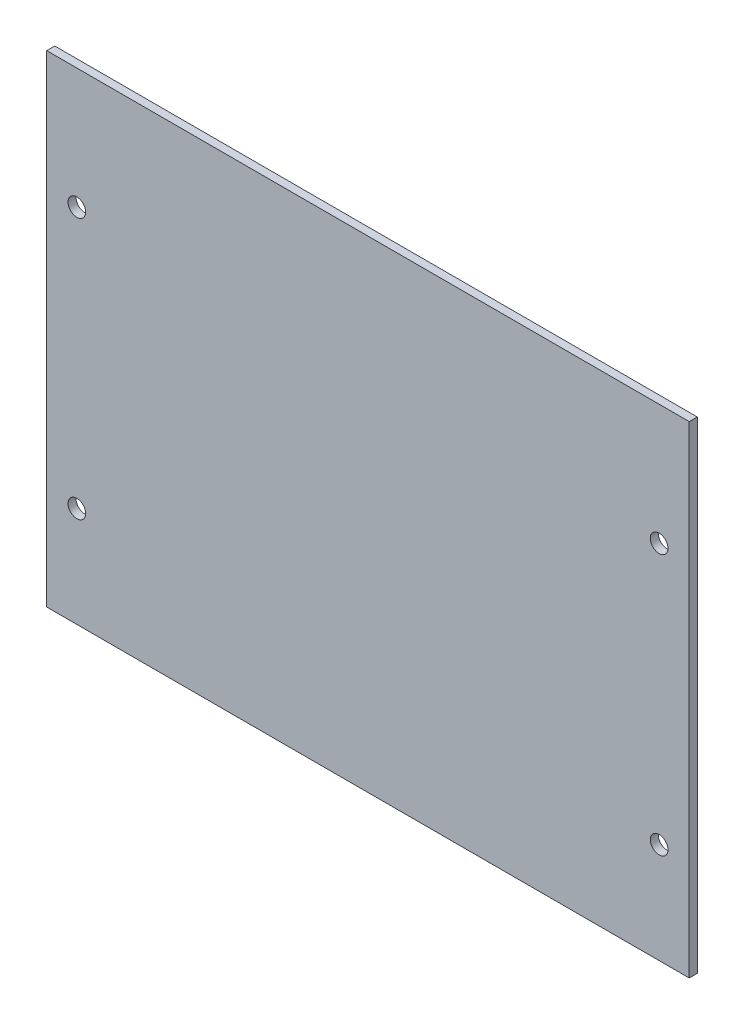
ISO-10303-21;
HEADER;
FILE_DESCRIPTION(('STEP AP214'),'2;1');
FILE_NAME('part.step','',(''),(''),'','','');
FILE_SCHEMA(('AUTOMOTIVE_DESIGN { 1 0 10303 214 1 1 1 1 }'));
ENDSEC;
DATA;
#1=APPLICATION_CONTEXT('core data for automotive mechanical design processes');
#2=APPLICATION_PROTOCOL_DEFINITION('international standard','automotive_design',2000,#1);
#3=PRODUCT_CONTEXT('',#1,'mechanical');
#4=PRODUCT('Part','Part','',(#3));
#5=PRODUCT_RELATED_PRODUCT_CATEGORY('part','',(#4));
#6=PRODUCT_DEFINITION_FORMATION('','',#4);
#7=PRODUCT_DEFINITION_CONTEXT('part definition',#1,'design');
#8=PRODUCT_DEFINITION('design','',#6,#7);
#9=PRODUCT_DEFINITION_SHAPE('','',#8);
#10=(LENGTH_UNIT() NAMED_UNIT(*) SI_UNIT(.MILLI.,.METRE.));
#11=(NAMED_UNIT(*) PLANE_ANGLE_UNIT() SI_UNIT($,.RADIAN.));
#12=(NAMED_UNIT(*) SI_UNIT($,.STERADIAN.) SOLID_ANGLE_UNIT());
#13=UNCERTAINTY_MEASURE_WITH_UNIT(LENGTH_MEASURE(1.E-05),#10,'distance_accuracy_value','');
#14=(GEOMETRIC_REPRESENTATION_CONTEXT(3) GLOBAL_UNCERTAINTY_ASSIGNED_CONTEXT((#13)) GLOBAL_UNIT_ASSIGNED_CONTEXT((#10,
#11,#12)) REPRESENTATION_CONTEXT('',''));
#15=CARTESIAN_POINT('',(0.,0.,0.));
#16=DIRECTION('',(0.,0.,1.));
#17=DIRECTION('',(1.,0.,0.));
#18=AXIS2_PLACEMENT_3D('',#15,#16,#17);
#19=CARTESIAN_POINT('',(80.,60.,2.));
#20=DIRECTION('',(-1.,0.,0.));
#21=DIRECTION('',(0.,-1.,0.));
#22=AXIS2_PLACEMENT_3D('',#19,#20,#21);
#23=PLANE('',#22);
#24=DIRECTION('',(0.,1.,0.));
#25=VECTOR('',#24,1.);
#26=CARTESIAN_POINT('',(80.,60.,0.));
#27=LINE('',#26,#25);
#28=CARTESIAN_POINT('',(80.,-60.,0.));
#29=VERTEX_POINT('',#28);
#30=CARTESIAN_POINT('',(80.,60.,0.));
#31=VERTEX_POINT('',#30);
#32=EDGE_CURVE('E100',#29,#31,#27,.T.);
#33=ORIENTED_EDGE('',*,*,#32,.T.);
#34=DIRECTION('',(0.,0.,-1.));
#35=VECTOR('',#34,1.);
#36=CARTESIAN_POINT('',(80.,60.,2.));
#37=LINE('',#36,#35);
#38=CARTESIAN_POINT('',(80.,60.,2.));
#39=VERTEX_POINT('',#38);
#40=EDGE_CURVE('E11',#39,#31,#37,.T.);
#41=ORIENTED_EDGE('',*,*,#40,.F.);
#42=DIRECTION('',(0.,1.,0.));
#43=VECTOR('',#42,1.);
#44=CARTESIAN_POINT('',(80.,60.,2.));
#45=LINE('',#44,#43);
#46=CARTESIAN_POINT('',(80.,-60.,2.));
#47=VERTEX_POINT('',#46);
#48=EDGE_CURVE('E88',#47,#39,#45,.T.);
#49=ORIENTED_EDGE('',*,*,#48,.F.);
#50=DIRECTION('',(0.,0.,-1.));
#51=VECTOR('',#50,1.);
#52=CARTESIAN_POINT('',(80.,-60.,2.));
#53=LINE('',#52,#51);
#54=EDGE_CURVE('E96',#47,#29,#53,.T.);
#55=ORIENTED_EDGE('',*,*,#54,.T.);
#56=EDGE_LOOP('',(#33,#41,#49,#55));
#57=FACE_BOUND('',#56,.T.);
#58=ADVANCED_FACE('F37',(#57),#23,.F.);
#59=CARTESIAN_POINT('',(-80.,60.,2.));
#60=DIRECTION('',(0.,-1.,0.));
#61=DIRECTION('',(0.,0.,-1.));
#62=AXIS2_PLACEMENT_3D('',#59,#60,#61);
#63=PLANE('',#62);
#64=DIRECTION('',(-1.,0.,0.));
#65=VECTOR('',#64,1.);
#66=CARTESIAN_POINT('',(-80.,60.,0.));
#67=LINE('',#66,#65);
#68=CARTESIAN_POINT('',(-80.,60.,0.));
#69=VERTEX_POINT('',#68);
#70=EDGE_CURVE('E92',#31,#69,#67,.T.);
#71=ORIENTED_EDGE('',*,*,#70,.T.);
#72=DIRECTION('',(0.,0.,-1.));
#73=VECTOR('',#72,1.);
#74=CARTESIAN_POINT('',(-80.,60.,2.));
#75=LINE('',#74,#73);
#76=CARTESIAN_POINT('',(-80.,60.,2.));
#77=VERTEX_POINT('',#76);
#78=EDGE_CURVE('E45',#77,#69,#75,.T.);
#79=ORIENTED_EDGE('',*,*,#78,.F.);
#80=DIRECTION('',(-1.,0.,0.));
#81=VECTOR('',#80,1.);
#82=CARTESIAN_POINT('',(-80.,60.,2.));
#83=LINE('',#82,#81);
#84=EDGE_CURVE('E83',#39,#77,#83,.T.);
#85=ORIENTED_EDGE('',*,*,#84,.F.);
#86=ORIENTED_EDGE('',*,*,#40,.T.);
#87=EDGE_LOOP('',(#71,#79,#85,#86));
#88=FACE_BOUND('',#87,.T.);
#89=ADVANCED_FACE('F91',(#88),#63,.F.);
#90=CARTESIAN_POINT('',(-80.,60.,2.));
#91=DIRECTION('',(1.,0.,0.));
#92=DIRECTION('',(0.,1.,0.));
#93=AXIS2_PLACEMENT_3D('',#90,#91,#92);
#94=PLANE('',#93);
#95=DIRECTION('',(0.,-1.,0.));
#96=VECTOR('',#95,1.);
#97=CARTESIAN_POINT('',(-80.,60.,0.));
#98=LINE('',#97,#96);
#99=CARTESIAN_POINT('',(-80.,-60.,0.));
#100=VERTEX_POINT('',#99);
#101=EDGE_CURVE('E70',#69,#100,#98,.T.);
#102=ORIENTED_EDGE('',*,*,#101,.T.);
#103=DIRECTION('',(0.,0.,-1.));
#104=VECTOR('',#103,1.);
#105=CARTESIAN_POINT('',(-80.,-60.,2.));
#106=LINE('',#105,#104);
#107=CARTESIAN_POINT('',(-80.,-60.,2.));
#108=VERTEX_POINT('',#107);
#109=EDGE_CURVE('E93',#108,#100,#106,.T.);
#110=ORIENTED_EDGE('',*,*,#109,.F.);
#111=DIRECTION('',(0.,-1.,0.));
#112=VECTOR('',#111,1.);
#113=CARTESIAN_POINT('',(-80.,60.,2.));
#114=LINE('',#113,#112);
#115=EDGE_CURVE('E86',#77,#108,#114,.T.);
#116=ORIENTED_EDGE('',*,*,#115,.F.);
#117=ORIENTED_EDGE('',*,*,#78,.T.);
#118=EDGE_LOOP('',(#102,#110,#116,#117));
#119=FACE_BOUND('',#118,.T.);
#120=ADVANCED_FACE('F94',(#119),#94,.F.);
#121=CARTESIAN_POINT('',(-80.,-60.,2.));
#122=DIRECTION('',(0.,1.,0.));
#123=DIRECTION('',(0.,0.,1.));
#124=AXIS2_PLACEMENT_3D('',#121,#122,#123);
#125=PLANE('',#124);
#126=DIRECTION('',(1.,0.,0.));
#127=VECTOR('',#126,1.);
#128=CARTESIAN_POINT('',(-80.,-60.,0.));
#129=LINE('',#128,#127);
#130=EDGE_CURVE('E76',#100,#29,#129,.T.);
#131=ORIENTED_EDGE('',*,*,#130,.T.);
#132=ORIENTED_EDGE('',*,*,#54,.F.);
#133=DIRECTION('',(1.,0.,0.));
#134=VECTOR('',#133,1.);
#135=CARTESIAN_POINT('',(-80.,-60.,2.));
#136=LINE('',#135,#134);
#137=EDGE_CURVE('E53',#108,#47,#136,.T.);
#138=ORIENTED_EDGE('',*,*,#137,.F.);
#139=ORIENTED_EDGE('',*,*,#109,.T.);
#140=EDGE_LOOP('',(#131,#132,#138,#139));
#141=FACE_BOUND('',#140,.T.);
#142=ADVANCED_FACE('F108',(#141),#125,.F.);
#143=CARTESIAN_POINT('',(0.,0.,2.));
#144=DIRECTION('',(0.,0.,1.));
#145=DIRECTION('',(1.,0.,0.));
#146=AXIS2_PLACEMENT_3D('',#143,#144,#145);
#147=PLANE('',#146);
#148=CARTESIAN_POINT('',(72.5,30.,2.));
#149=DIRECTION('',(0.,0.,1.));
#150=DIRECTION('',(1.,0.,0.));
#151=AXIS2_PLACEMENT_3D('',#148,#149,#150);
#152=CIRCLE('',#151,2.20000000000001);
#153=CARTESIAN_POINT('',(74.7,30.,2.));
#154=VERTEX_POINT('',#153);
#155=EDGE_CURVE('E120',#154,#154,#152,.T.);
#156=ORIENTED_EDGE('',*,*,#155,.F.);
#157=EDGE_LOOP('',(#156));
#158=FACE_BOUND('',#157,.T.);
#159=CARTESIAN_POINT('',(72.5,-35.,2.));
#160=DIRECTION('',(0.,0.,1.));
#161=DIRECTION('',(1.,0.,0.));
#162=AXIS2_PLACEMENT_3D('',#159,#160,#161);
#163=CIRCLE('',#162,2.2);
#164=CARTESIAN_POINT('',(74.7,-35.,2.));
#165=VERTEX_POINT('',#164);
#166=EDGE_CURVE('E126',#165,#165,#163,.T.);
#167=ORIENTED_EDGE('',*,*,#166,.F.);
#168=EDGE_LOOP('',(#167));
#169=FACE_BOUND('',#168,.T.);
#170=CARTESIAN_POINT('',(-72.5,-35.,2.));
#171=DIRECTION('',(0.,0.,1.));
#172=DIRECTION('',(1.,0.,0.));
#173=AXIS2_PLACEMENT_3D('',#170,#171,#172);
#174=CIRCLE('',#173,2.2);
#175=CARTESIAN_POINT('',(-70.3,-35.,2.));
#176=VERTEX_POINT('',#175);
#177=EDGE_CURVE('E132',#176,#176,#174,.T.);
#178=ORIENTED_EDGE('',*,*,#177,.F.);
#179=EDGE_LOOP('',(#178));
#180=FACE_BOUND('',#179,.T.);
#181=CARTESIAN_POINT('',(-72.5,30.,2.));
#182=DIRECTION('',(0.,0.,1.));
#183=DIRECTION('',(1.,0.,0.));
#184=AXIS2_PLACEMENT_3D('',#181,#182,#183);
#185=CIRCLE('',#184,2.2);
#186=CARTESIAN_POINT('',(-70.3,30.,2.));
#187=VERTEX_POINT('',#186);
#188=EDGE_CURVE('E114',#187,#187,#185,.T.);
#189=ORIENTED_EDGE('',*,*,#188,.F.);
#190=EDGE_LOOP('',(#189));
#191=FACE_BOUND('',#190,.T.);
#192=ORIENTED_EDGE('',*,*,#48,.T.);
#193=ORIENTED_EDGE('',*,*,#84,.T.);
#194=ORIENTED_EDGE('',*,*,#115,.T.);
#195=ORIENTED_EDGE('',*,*,#137,.T.);
#196=EDGE_LOOP('',(#192,#193,#194,#195));
#197=FACE_BOUND('',#196,.T.);
#198=ADVANCED_FACE('F84',(#158,#169,#180,#191,#197),#147,.T.);
#199=CARTESIAN_POINT('',(0.,0.,0.));
#200=DIRECTION('',(0.,0.,1.));
#201=DIRECTION('',(1.,0.,0.));
#202=AXIS2_PLACEMENT_3D('',#199,#200,#201);
#203=PLANE('',#202);
#204=CARTESIAN_POINT('',(72.5,30.,0.));
#205=DIRECTION('',(0.,0.,1.));
#206=DIRECTION('',(1.,0.,0.));
#207=AXIS2_PLACEMENT_3D('',#204,#205,#206);
#208=CIRCLE('',#207,2.20000000000001);
#209=CARTESIAN_POINT('',(74.7,30.,0.));
#210=VERTEX_POINT('',#209);
#211=EDGE_CURVE('E123',#210,#210,#208,.T.);
#212=ORIENTED_EDGE('',*,*,#211,.T.);
#213=EDGE_LOOP('',(#212));
#214=FACE_BOUND('',#213,.T.);
#215=CARTESIAN_POINT('',(72.5,-35.,0.));
#216=DIRECTION('',(0.,0.,1.));
#217=DIRECTION('',(1.,0.,0.));
#218=AXIS2_PLACEMENT_3D('',#215,#216,#217);
#219=CIRCLE('',#218,2.2);
#220=CARTESIAN_POINT('',(74.7,-35.,0.));
#221=VERTEX_POINT('',#220);
#222=EDGE_CURVE('E129',#221,#221,#219,.T.);
#223=ORIENTED_EDGE('',*,*,#222,.T.);
#224=EDGE_LOOP('',(#223));
#225=FACE_BOUND('',#224,.T.);
#226=CARTESIAN_POINT('',(-72.5,-35.,0.));
#227=DIRECTION('',(0.,0.,1.));
#228=DIRECTION('',(1.,0.,0.));
#229=AXIS2_PLACEMENT_3D('',#226,#227,#228);
#230=CIRCLE('',#229,2.2);
#231=CARTESIAN_POINT('',(-70.3,-35.,0.));
#232=VERTEX_POINT('',#231);
#233=EDGE_CURVE('E117',#232,#232,#230,.T.);
#234=ORIENTED_EDGE('',*,*,#233,.T.);
#235=EDGE_LOOP('',(#234));
#236=FACE_BOUND('',#235,.T.);
#237=CARTESIAN_POINT('',(-72.5,30.,0.));
#238=DIRECTION('',(0.,0.,1.));
#239=DIRECTION('',(1.,0.,0.));
#240=AXIS2_PLACEMENT_3D('',#237,#238,#239);
#241=CIRCLE('',#240,2.2);
#242=CARTESIAN_POINT('',(-70.3,30.,0.));
#243=VERTEX_POINT('',#242);
#244=EDGE_CURVE('E103',#243,#243,#241,.T.);
#245=ORIENTED_EDGE('',*,*,#244,.T.);
#246=EDGE_LOOP('',(#245));
#247=FACE_BOUND('',#246,.T.);
#248=ORIENTED_EDGE('',*,*,#32,.F.);
#249=ORIENTED_EDGE('',*,*,#130,.F.);
#250=ORIENTED_EDGE('',*,*,#101,.F.);
#251=ORIENTED_EDGE('',*,*,#70,.F.);
#252=EDGE_LOOP('',(#248,#249,#250,#251));
#253=FACE_BOUND('',#252,.T.);
#254=ADVANCED_FACE('F111',(#214,#225,#236,#247,#253),#203,.F.);
#255=CARTESIAN_POINT('',(-72.5,30.,0.));
#256=DIRECTION('',(0.,0.,1.));
#257=DIRECTION('',(1.,0.,0.));
#258=AXIS2_PLACEMENT_3D('',#255,#256,#257);
#259=CYLINDRICAL_SURFACE('',#258,2.2);
#260=ORIENTED_EDGE('',*,*,#244,.F.);
#261=EDGE_LOOP('',(#260));
#262=FACE_BOUND('',#261,.T.);
#263=ORIENTED_EDGE('',*,*,#188,.T.);
#264=EDGE_LOOP('',(#263));
#265=FACE_BOUND('',#264,.T.);
#266=ADVANCED_FACE('F144',(#262,#265),#259,.F.);
#267=CARTESIAN_POINT('',(-72.5,-35.,0.));
#268=DIRECTION('',(0.,0.,1.));
#269=DIRECTION('',(1.,0.,0.));
#270=AXIS2_PLACEMENT_3D('',#267,#268,#269);
#271=CYLINDRICAL_SURFACE('',#270,2.2);
#272=ORIENTED_EDGE('',*,*,#233,.F.);
#273=EDGE_LOOP('',(#272));
#274=FACE_BOUND('',#273,.T.);
#275=ORIENTED_EDGE('',*,*,#177,.T.);
#276=EDGE_LOOP('',(#275));
#277=FACE_BOUND('',#276,.T.);
#278=ADVANCED_FACE('F140',(#274,#277),#271,.F.);
#279=CARTESIAN_POINT('',(72.5,-35.,0.));
#280=DIRECTION('',(0.,0.,1.));
#281=DIRECTION('',(1.,0.,0.));
#282=AXIS2_PLACEMENT_3D('',#279,#280,#281);
#283=CYLINDRICAL_SURFACE('',#282,2.2);
#284=ORIENTED_EDGE('',*,*,#222,.F.);
#285=EDGE_LOOP('',(#284));
#286=FACE_BOUND('',#285,.T.);
#287=ORIENTED_EDGE('',*,*,#166,.T.);
#288=EDGE_LOOP('',(#287));
#289=FACE_BOUND('',#288,.T.);
#290=ADVANCED_FACE('F143',(#286,#289),#283,.F.);
#291=CARTESIAN_POINT('',(72.5,30.,0.));
#292=DIRECTION('',(0.,0.,1.));
#293=DIRECTION('',(1.,0.,0.));
#294=AXIS2_PLACEMENT_3D('',#291,#292,#293);
#295=CYLINDRICAL_SURFACE('',#294,2.20000000000001);
#296=ORIENTED_EDGE('',*,*,#211,.F.);
#297=EDGE_LOOP('',(#296));
#298=FACE_BOUND('',#297,.T.);
#299=ORIENTED_EDGE('',*,*,#155,.T.);
#300=EDGE_LOOP('',(#299));
#301=FACE_BOUND('',#300,.T.);
#302=ADVANCED_FACE('F205',(#298,#301),#295,.F.);
#303=CLOSED_SHELL('',(#58,#89,#120,#142,#198,#254,#266,#278,#290,#302));
#304=MANIFOLD_SOLID_BREP('B2',#303);
#305=ADVANCED_BREP_SHAPE_REPRESENTATION('',(#18,#304),#14);
#306=SHAPE_DEFINITION_REPRESENTATION(#9,#305);
ENDSEC;
END-ISO-10303-21;
